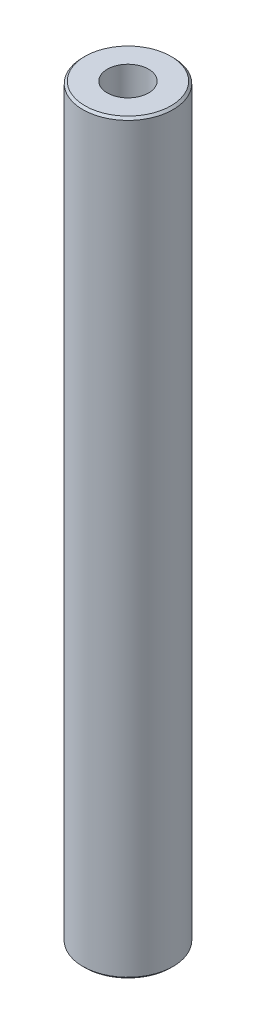
ISO-10303-21;
HEADER;
FILE_DESCRIPTION(('STEP AP214'),'2;1');
FILE_NAME('part.step','',(''),(''),'','','');
FILE_SCHEMA(('AUTOMOTIVE_DESIGN { 1 0 10303 214 1 1 1 1 }'));
ENDSEC;
DATA;
#1=APPLICATION_CONTEXT('core data for automotive mechanical design processes');
#2=APPLICATION_PROTOCOL_DEFINITION('international standard','automotive_design',2000,#1);
#3=PRODUCT_CONTEXT('',#1,'mechanical');
#4=PRODUCT('Part','Part','',(#3));
#5=PRODUCT_RELATED_PRODUCT_CATEGORY('part','',(#4));
#6=PRODUCT_DEFINITION_FORMATION('','',#4);
#7=PRODUCT_DEFINITION_CONTEXT('part definition',#1,'design');
#8=PRODUCT_DEFINITION('design','',#6,#7);
#9=PRODUCT_DEFINITION_SHAPE('','',#8);
#10=(LENGTH_UNIT() NAMED_UNIT(*) SI_UNIT(.MILLI.,.METRE.));
#11=(NAMED_UNIT(*) PLANE_ANGLE_UNIT() SI_UNIT($,.RADIAN.));
#12=(NAMED_UNIT(*) SI_UNIT($,.STERADIAN.) SOLID_ANGLE_UNIT());
#13=UNCERTAINTY_MEASURE_WITH_UNIT(LENGTH_MEASURE(1.E-05),#10,'distance_accuracy_value','');
#14=(GEOMETRIC_REPRESENTATION_CONTEXT(3) GLOBAL_UNCERTAINTY_ASSIGNED_CONTEXT((#13)) GLOBAL_UNIT_ASSIGNED_CONTEXT((#10,
#11,#12)) REPRESENTATION_CONTEXT('',''));
#15=CARTESIAN_POINT('',(0.,0.,0.));
#16=DIRECTION('',(0.,0.,1.));
#17=DIRECTION('',(1.,0.,0.));
#18=AXIS2_PLACEMENT_3D('',#15,#16,#17);
#19=CARTESIAN_POINT('',(0.,248.133667648853,0.));
#20=DIRECTION('',(0.,-1.,0.));
#21=DIRECTION('',(0.,0.,-1.));
#22=AXIS2_PLACEMENT_3D('',#19,#20,#21);
#23=CYLINDRICAL_SURFACE('',#22,15.);
#24=CARTESIAN_POINT('',(0.,247.409126220803,0.));
#25=DIRECTION('',(0.,1.,0.));
#26=DIRECTION('',(0.,0.,1.));
#27=AXIS2_PLACEMENT_3D('',#24,#25,#26);
#28=CIRCLE('',#27,15.);
#29=CARTESIAN_POINT('',(0.,247.409126220803,15.));
#30=VERTEX_POINT('',#29);
#31=EDGE_CURVE('E50',#30,#30,#28,.F.);
#32=ORIENTED_EDGE('',*,*,#31,.T.);
#33=EDGE_LOOP('',(#32));
#34=FACE_BOUND('',#33,.T.);
#35=CARTESIAN_POINT('',(0.,0.724541428050646,0.));
#36=DIRECTION('',(0.,1.,0.));
#37=DIRECTION('',(0.,0.,1.));
#38=AXIS2_PLACEMENT_3D('',#35,#36,#37);
#39=CIRCLE('',#38,15.);
#40=CARTESIAN_POINT('',(0.,0.724541428050646,15.));
#41=VERTEX_POINT('',#40);
#42=EDGE_CURVE('E51',#41,#41,#39,.T.);
#43=ORIENTED_EDGE('',*,*,#42,.T.);
#44=EDGE_LOOP('',(#43));
#45=FACE_BOUND('',#44,.T.);
#46=ADVANCED_FACE('F39',(#34,#45),#23,.T.);
#47=CARTESIAN_POINT('',(0.,248.133667648853,0.));
#48=DIRECTION('',(0.,1.,0.));
#49=DIRECTION('',(0.,0.,1.));
#50=AXIS2_PLACEMENT_3D('',#47,#48,#49);
#51=PLANE('',#50);
#52=CARTESIAN_POINT('',(0.,248.133667648853,0.));
#53=DIRECTION('',(0.,1.,0.));
#54=DIRECTION('',(0.,0.,1.));
#55=AXIS2_PLACEMENT_3D('',#52,#53,#54);
#56=CIRCLE('',#55,14.2754585719493);
#57=CARTESIAN_POINT('',(0.,248.133667648853,14.2754585719493));
#58=VERTEX_POINT('',#57);
#59=EDGE_CURVE('E54',#58,#58,#56,.T.);
#60=ORIENTED_EDGE('',*,*,#59,.T.);
#61=EDGE_LOOP('',(#60));
#62=FACE_BOUND('',#61,.T.);
#63=CARTESIAN_POINT('',(0.,248.133667648853,0.));
#64=DIRECTION('',(0.,1.,0.));
#65=DIRECTION('',(0.,0.,1.));
#66=AXIS2_PLACEMENT_3D('',#63,#64,#65);
#67=CIRCLE('',#66,6.86399994605096);
#68=CARTESIAN_POINT('',(0.,248.133667648853,6.86399994605096));
#69=VERTEX_POINT('',#68);
#70=EDGE_CURVE('E58',#69,#69,#67,.T.);
#71=ORIENTED_EDGE('',*,*,#70,.F.);
#72=EDGE_LOOP('',(#71));
#73=FACE_BOUND('',#72,.T.);
#74=ADVANCED_FACE('F69',(#62,#73),#51,.T.);
#75=CARTESIAN_POINT('',(0.,0.,0.));
#76=DIRECTION('',(0.,1.,0.));
#77=DIRECTION('',(0.,0.,1.));
#78=AXIS2_PLACEMENT_3D('',#75,#76,#77);
#79=PLANE('',#78);
#80=CARTESIAN_POINT('',(0.,0.,0.));
#81=DIRECTION('',(0.,1.,0.));
#82=DIRECTION('',(0.,0.,1.));
#83=AXIS2_PLACEMENT_3D('',#80,#81,#82);
#84=CIRCLE('',#83,14.2754585719493);
#85=CARTESIAN_POINT('',(0.,0.,14.2754585719493));
#86=VERTEX_POINT('',#85);
#87=EDGE_CURVE('E10',#86,#86,#84,.F.);
#88=ORIENTED_EDGE('',*,*,#87,.T.);
#89=EDGE_LOOP('',(#88));
#90=FACE_BOUND('',#89,.T.);
#91=CARTESIAN_POINT('',(0.,0.,0.));
#92=DIRECTION('',(0.,1.,0.));
#93=DIRECTION('',(0.,0.,1.));
#94=AXIS2_PLACEMENT_3D('',#91,#92,#93);
#95=CIRCLE('',#94,6.86399994605096);
#96=CARTESIAN_POINT('',(0.,0.,6.86399994605096));
#97=VERTEX_POINT('',#96);
#98=EDGE_CURVE('E63',#97,#97,#95,.T.);
#99=ORIENTED_EDGE('',*,*,#98,.T.);
#100=EDGE_LOOP('',(#99));
#101=FACE_BOUND('',#100,.T.);
#102=ADVANCED_FACE('F75',(#90,#101),#79,.F.);
#103=CARTESIAN_POINT('',(0.,248.133667648853,0.));
#104=DIRECTION('',(0.,-1.,0.));
#105=DIRECTION('',(0.,0.,-1.));
#106=AXIS2_PLACEMENT_3D('',#103,#104,#105);
#107=CYLINDRICAL_SURFACE('',#106,6.86399994605096);
#108=ORIENTED_EDGE('',*,*,#70,.T.);
#109=EDGE_LOOP('',(#108));
#110=FACE_BOUND('',#109,.T.);
#111=ORIENTED_EDGE('',*,*,#98,.F.);
#112=EDGE_LOOP('',(#111));
#113=FACE_BOUND('',#112,.T.);
#114=ADVANCED_FACE('F70',(#110,#113),#107,.F.);
#115=CARTESIAN_POINT('',(0.,248.133667648853,0.));
#116=DIRECTION('',(0.,-1.,0.));
#117=DIRECTION('',(0.,0.,-1.));
#118=AXIS2_PLACEMENT_3D('',#115,#116,#117);
#119=CONICAL_SURFACE('',#118,14.2754585719493,0.785398163397457);
#120=ORIENTED_EDGE('',*,*,#31,.F.);
#121=EDGE_LOOP('',(#120));
#122=FACE_BOUND('',#121,.T.);
#123=ORIENTED_EDGE('',*,*,#59,.F.);
#124=EDGE_LOOP('',(#123));
#125=FACE_BOUND('',#124,.T.);
#126=ADVANCED_FACE('F81',(#122,#125),#119,.T.);
#127=CARTESIAN_POINT('',(0.,0.724541428050646,0.));
#128=DIRECTION('',(0.,1.,0.));
#129=DIRECTION('',(0.,0.,1.));
#130=AXIS2_PLACEMENT_3D('',#127,#128,#129);
#131=CONICAL_SURFACE('',#130,15.,0.785398163397458);
#132=ORIENTED_EDGE('',*,*,#87,.F.);
#133=EDGE_LOOP('',(#132));
#134=FACE_BOUND('',#133,.T.);
#135=ORIENTED_EDGE('',*,*,#42,.F.);
#136=EDGE_LOOP('',(#135));
#137=FACE_BOUND('',#136,.T.);
#138=ADVANCED_FACE('F45',(#134,#137),#131,.T.);
#139=CLOSED_SHELL('',(#46,#74,#102,#114,#126,#138));
#140=MANIFOLD_SOLID_BREP('B2',#139);
#141=ADVANCED_BREP_SHAPE_REPRESENTATION('',(#18,#140),#14);
#142=SHAPE_DEFINITION_REPRESENTATION(#9,#141);
ENDSEC;
END-ISO-10303-21;
